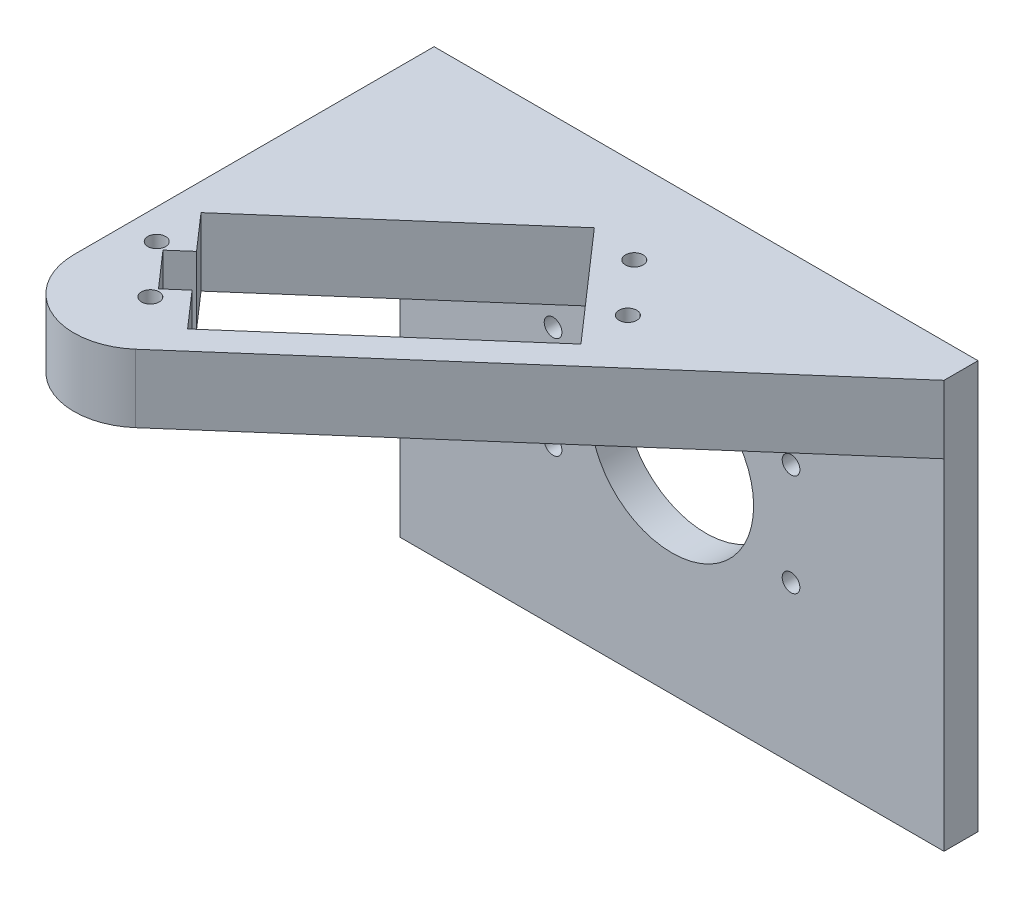
ISO-10303-21;
HEADER;
FILE_DESCRIPTION(('STEP AP214'),'2;1');
FILE_NAME('part.step','',(''),(''),'','','');
FILE_SCHEMA(('AUTOMOTIVE_DESIGN { 1 0 10303 214 1 1 1 1 }'));
ENDSEC;
DATA;
#1=APPLICATION_CONTEXT('core data for automotive mechanical design processes');
#2=APPLICATION_PROTOCOL_DEFINITION('international standard','automotive_design',2000,#1);
#3=PRODUCT_CONTEXT('',#1,'mechanical');
#4=PRODUCT('Part','Part','',(#3));
#5=PRODUCT_RELATED_PRODUCT_CATEGORY('part','',(#4));
#6=PRODUCT_DEFINITION_FORMATION('','',#4);
#7=PRODUCT_DEFINITION_CONTEXT('part definition',#1,'design');
#8=PRODUCT_DEFINITION('design','',#6,#7);
#9=PRODUCT_DEFINITION_SHAPE('','',#8);
#10=(LENGTH_UNIT() NAMED_UNIT(*) SI_UNIT(.MILLI.,.METRE.));
#11=(NAMED_UNIT(*) PLANE_ANGLE_UNIT() SI_UNIT($,.RADIAN.));
#12=(NAMED_UNIT(*) SI_UNIT($,.STERADIAN.) SOLID_ANGLE_UNIT());
#13=UNCERTAINTY_MEASURE_WITH_UNIT(LENGTH_MEASURE(1.E-05),#10,'distance_accuracy_value','');
#14=(GEOMETRIC_REPRESENTATION_CONTEXT(3) GLOBAL_UNCERTAINTY_ASSIGNED_CONTEXT((#13)) GLOBAL_UNIT_ASSIGNED_CONTEXT((#10,
#11,#12)) REPRESENTATION_CONTEXT('',''));
#15=CARTESIAN_POINT('',(0.,0.,0.));
#16=DIRECTION('',(0.,0.,1.));
#17=DIRECTION('',(1.,0.,0.));
#18=AXIS2_PLACEMENT_3D('',#15,#16,#17);
#19=CARTESIAN_POINT('',(0.,0.,0.));
#20=DIRECTION('',(0.,0.,1.));
#21=DIRECTION('',(1.,0.,0.));
#22=AXIS2_PLACEMENT_3D('',#19,#20,#21);
#23=PLANE('',#22);
#24=CARTESIAN_POINT('',(-17.5,8.,0.));
#25=DIRECTION('',(0.,0.,1.));
#26=DIRECTION('',(1.,0.,0.));
#27=AXIS2_PLACEMENT_3D('',#24,#25,#26);
#28=CIRCLE('',#27,1.3);
#29=CARTESIAN_POINT('',(-16.2,8.,0.));
#30=VERTEX_POINT('',#29);
#31=EDGE_CURVE('E658',#30,#30,#28,.T.);
#32=ORIENTED_EDGE('',*,*,#31,.T.);
#33=EDGE_LOOP('',(#32));
#34=FACE_BOUND('',#33,.T.);
#35=CARTESIAN_POINT('',(-17.5,-7.,0.));
#36=DIRECTION('',(0.,0.,1.));
#37=DIRECTION('',(1.,0.,0.));
#38=AXIS2_PLACEMENT_3D('',#35,#36,#37);
#39=CIRCLE('',#38,1.3);
#40=CARTESIAN_POINT('',(-16.2,-7.,0.));
#41=VERTEX_POINT('',#40);
#42=EDGE_CURVE('E664',#41,#41,#39,.T.);
#43=ORIENTED_EDGE('',*,*,#42,.T.);
#44=EDGE_LOOP('',(#43));
#45=FACE_BOUND('',#44,.T.);
#46=CARTESIAN_POINT('',(17.5,8.,0.));
#47=DIRECTION('',(0.,0.,1.));
#48=DIRECTION('',(1.,0.,0.));
#49=AXIS2_PLACEMENT_3D('',#46,#47,#48);
#50=CIRCLE('',#49,1.3);
#51=CARTESIAN_POINT('',(18.8,8.,0.));
#52=VERTEX_POINT('',#51);
#53=EDGE_CURVE('E672',#52,#52,#50,.T.);
#54=ORIENTED_EDGE('',*,*,#53,.T.);
#55=EDGE_LOOP('',(#54));
#56=FACE_BOUND('',#55,.T.);
#57=CARTESIAN_POINT('',(17.5,-7.,0.));
#58=DIRECTION('',(0.,0.,1.));
#59=DIRECTION('',(1.,0.,0.));
#60=AXIS2_PLACEMENT_3D('',#57,#58,#59);
#61=CIRCLE('',#60,1.3);
#62=CARTESIAN_POINT('',(18.8,-7.,0.));
#63=VERTEX_POINT('',#62);
#64=EDGE_CURVE('E289',#63,#63,#61,.T.);
#65=ORIENTED_EDGE('',*,*,#64,.T.);
#66=EDGE_LOOP('',(#65));
#67=FACE_BOUND('',#66,.T.);
#68=DIRECTION('',(1.,0.,0.));
#69=VECTOR('',#68,1.);
#70=CARTESIAN_POINT('',(-40.,-30.,0.));
#71=LINE('',#70,#69);
#72=CARTESIAN_POINT('',(-40.,-30.,0.));
#73=VERTEX_POINT('',#72);
#74=CARTESIAN_POINT('',(40.,-30.,0.));
#75=VERTEX_POINT('',#74);
#76=EDGE_CURVE('E300',#73,#75,#71,.T.);
#77=ORIENTED_EDGE('',*,*,#76,.F.);
#78=DIRECTION('',(0.,-1.,0.));
#79=VECTOR('',#78,1.);
#80=CARTESIAN_POINT('',(-40.,30.,0.));
#81=LINE('',#80,#79);
#82=CARTESIAN_POINT('',(-40.,30.,0.));
#83=VERTEX_POINT('',#82);
#84=EDGE_CURVE('E311',#83,#73,#81,.T.);
#85=ORIENTED_EDGE('',*,*,#84,.F.);
#86=DIRECTION('',(-1.,0.,0.));
#87=VECTOR('',#86,1.);
#88=CARTESIAN_POINT('',(-40.,30.,0.));
#89=LINE('',#88,#87);
#90=CARTESIAN_POINT('',(40.,30.,0.));
#91=VERTEX_POINT('',#90);
#92=EDGE_CURVE('E308',#91,#83,#89,.T.);
#93=ORIENTED_EDGE('',*,*,#92,.F.);
#94=DIRECTION('',(0.,1.,0.));
#95=VECTOR('',#94,1.);
#96=CARTESIAN_POINT('',(40.,30.,0.));
#97=LINE('',#96,#95);
#98=EDGE_CURVE('E296',#75,#91,#97,.T.);
#99=ORIENTED_EDGE('',*,*,#98,.F.);
#100=EDGE_LOOP('',(#77,#85,#93,#99));
#101=FACE_BOUND('',#100,.T.);
#102=CARTESIAN_POINT('',(0.,0.,0.));
#103=DIRECTION('',(0.,0.,-1.));
#104=DIRECTION('',(-1.,0.,0.));
#105=AXIS2_PLACEMENT_3D('',#102,#103,#104);
#106=CIRCLE('',#105,12.);
#107=CARTESIAN_POINT('',(-12.,0.,0.));
#108=VERTEX_POINT('',#107);
#109=EDGE_CURVE('E359',#108,#108,#106,.T.);
#110=ORIENTED_EDGE('',*,*,#109,.F.);
#111=EDGE_LOOP('',(#110));
#112=FACE_BOUND('',#111,.T.);
#113=ADVANCED_FACE('F45',(#34,#45,#56,#67,#101,#112),#23,.F.);
#114=CARTESIAN_POINT('',(40.,30.,5.));
#115=DIRECTION('',(-1.,0.,0.));
#116=DIRECTION('',(0.,-1.,0.));
#117=AXIS2_PLACEMENT_3D('',#114,#115,#116);
#118=PLANE('',#117);
#119=ORIENTED_EDGE('',*,*,#98,.T.);
#120=DIRECTION('',(0.,0.,-1.));
#121=VECTOR('',#120,1.);
#122=CARTESIAN_POINT('',(40.,30.,5.));
#123=LINE('',#122,#121);
#124=CARTESIAN_POINT('',(40.,30.,5.));
#125=VERTEX_POINT('',#124);
#126=EDGE_CURVE('E321',#125,#91,#123,.T.);
#127=ORIENTED_EDGE('',*,*,#126,.F.);
#128=DIRECTION('',(0.,1.,0.));
#129=VECTOR('',#128,1.);
#130=CARTESIAN_POINT('',(40.,20.,5.));
#131=LINE('',#130,#129);
#132=CARTESIAN_POINT('',(40.,20.,5.));
#133=VERTEX_POINT('',#132);
#134=EDGE_CURVE('E281',#133,#125,#131,.T.);
#135=ORIENTED_EDGE('',*,*,#134,.F.);
#136=DIRECTION('',(0.,1.,0.));
#137=VECTOR('',#136,1.);
#138=CARTESIAN_POINT('',(40.,30.,5.));
#139=LINE('',#138,#137);
#140=CARTESIAN_POINT('',(40.,-30.,5.));
#141=VERTEX_POINT('',#140);
#142=EDGE_CURVE('E297',#141,#133,#139,.T.);
#143=ORIENTED_EDGE('',*,*,#142,.F.);
#144=DIRECTION('',(0.,0.,-1.));
#145=VECTOR('',#144,1.);
#146=CARTESIAN_POINT('',(40.,-30.,5.));
#147=LINE('',#146,#145);
#148=EDGE_CURVE('E306',#141,#75,#147,.T.);
#149=ORIENTED_EDGE('',*,*,#148,.T.);
#150=EDGE_LOOP('',(#119,#127,#135,#143,#149));
#151=FACE_BOUND('',#150,.T.);
#152=ADVANCED_FACE('F425',(#151),#118,.F.);
#153=CARTESIAN_POINT('',(-40.,30.,5.));
#154=DIRECTION('',(0.,-1.,0.));
#155=DIRECTION('',(0.,0.,-1.));
#156=AXIS2_PLACEMENT_3D('',#153,#154,#155);
#157=PLANE('',#156);
#158=CARTESIAN_POINT('',(-35.5766756092274,30.,45.2186107395333));
#159=DIRECTION('',(0.,-1.,0.));
#160=DIRECTION('',(0.,0.,-1.));
#161=AXIS2_PLACEMENT_3D('',#158,#159,#160);
#162=CIRCLE('',#161,1.3);
#163=CARTESIAN_POINT('',(-35.5766756092274,30.,43.9186107395333));
#164=VERTEX_POINT('',#163);
#165=EDGE_CURVE('E194',#164,#164,#162,.T.);
#166=ORIENTED_EDGE('',*,*,#165,.T.);
#167=EDGE_LOOP('',(#166));
#168=FACE_BOUND('',#167,.T.);
#169=CARTESIAN_POINT('',(-28.9916295305422,30.,52.744377686602));
#170=DIRECTION('',(0.,-1.,0.));
#171=DIRECTION('',(0.,0.,-1.));
#172=AXIS2_PLACEMENT_3D('',#169,#170,#171);
#173=CIRCLE('',#172,1.3);
#174=CARTESIAN_POINT('',(-28.9916295305422,30.,51.4443776866021));
#175=VERTEX_POINT('',#174);
#176=EDGE_CURVE('E366',#175,#175,#173,.T.);
#177=ORIENTED_EDGE('',*,*,#176,.T.);
#178=EDGE_LOOP('',(#177));
#179=FACE_BOUND('',#178,.T.);
#180=CARTESIAN_POINT('',(8.47163833196618,30.,19.9640183069072));
#181=DIRECTION('',(0.,-1.,0.));
#182=DIRECTION('',(0.,0.,-1.));
#183=AXIS2_PLACEMENT_3D('',#180,#181,#182);
#184=CIRCLE('',#183,1.3);
#185=CARTESIAN_POINT('',(8.47163833196618,30.,18.6640183069072));
#186=VERTEX_POINT('',#185);
#187=EDGE_CURVE('E270',#186,#186,#184,.T.);
#188=ORIENTED_EDGE('',*,*,#187,.T.);
#189=EDGE_LOOP('',(#188));
#190=FACE_BOUND('',#189,.T.);
#191=CARTESIAN_POINT('',(1.886592253281,30.,12.4382513598384));
#192=DIRECTION('',(0.,-1.,0.));
#193=DIRECTION('',(0.,0.,-1.));
#194=AXIS2_PLACEMENT_3D('',#191,#192,#193);
#195=CIRCLE('',#194,1.3);
#196=CARTESIAN_POINT('',(1.886592253281,30.,11.1382513598384));
#197=VERTEX_POINT('',#196);
#198=EDGE_CURVE('E213',#197,#197,#195,.T.);
#199=ORIENTED_EDGE('',*,*,#198,.T.);
#200=EDGE_LOOP('',(#199));
#201=FACE_BOUND('',#200,.T.);
#202=DIRECTION('',(-0.752576694706879,0.,0.658504607868517));
#203=VECTOR('',#202,1.);
#204=CARTESIAN_POINT('',(-31.3904677449204,30.,43.5488311981524));
#205=LINE('',#204,#203);
#206=CARTESIAN_POINT('',(-31.3904677449204,30.,43.5488311981524));
#207=VERTEX_POINT('',#206);
#208=CARTESIAN_POINT('',(-34.0244861763944,30.,45.8535973256922));
#209=VERTEX_POINT('',#208);
#210=EDGE_CURVE('E174',#207,#209,#205,.T.);
#211=ORIENTED_EDGE('',*,*,#210,.F.);
#212=DIRECTION('',(0.658504607868518,0.,0.752576694706878));
#213=VECTOR('',#212,1.);
#214=CARTESIAN_POINT('',(-36.,30.,38.2807943352042));
#215=LINE('',#214,#213);
#216=CARTESIAN_POINT('',(-36.,30.,38.2807943352042));
#217=VERTEX_POINT('',#216);
#218=EDGE_CURVE('E151',#217,#207,#215,.T.);
#219=ORIENTED_EDGE('',*,*,#218,.F.);
#220=DIRECTION('',(-0.752576694706878,0.,0.658504607868518));
#221=VECTOR('',#220,1.);
#222=CARTESIAN_POINT('',(-36.,30.,38.2807943352042));
#223=LINE('',#222,#221);
#224=CARTESIAN_POINT('',(-5.14435551701801,30.,11.282105412595));
#225=VERTEX_POINT('',#224);
#226=EDGE_CURVE('E163',#225,#217,#223,.T.);
#227=ORIENTED_EDGE('',*,*,#226,.F.);
#228=DIRECTION('',(-0.658504607868519,0.,-0.752576694706877));
#229=VECTOR('',#228,1.);
#230=CARTESIAN_POINT('',(-5.14435551701801,30.,11.282105412595));
#231=LINE('',#230,#229);
#232=CARTESIAN_POINT('',(8.68424124822089,30.,27.0862160014394));
#233=VERTEX_POINT('',#232);
#234=EDGE_CURVE('E219',#233,#225,#231,.T.);
#235=ORIENTED_EDGE('',*,*,#234,.F.);
#236=DIRECTION('',(0.752576694706878,0.,-0.658504607868518));
#237=VECTOR('',#236,1.);
#238=CARTESIAN_POINT('',(-22.1714032347611,30.,54.0849049240487));
#239=LINE('',#238,#237);
#240=CARTESIAN_POINT('',(-22.1714032347611,30.,54.0849049240487));
#241=VERTEX_POINT('',#240);
#242=EDGE_CURVE('E225',#241,#233,#239,.T.);
#243=ORIENTED_EDGE('',*,*,#242,.F.);
#244=DIRECTION('',(0.658504607868519,0.,0.752576694706877));
#245=VECTOR('',#244,1.);
#246=CARTESIAN_POINT('',(-26.7809354898407,30.,48.8168680611005));
#247=LINE('',#246,#245);
#248=CARTESIAN_POINT('',(-26.7809354898407,30.,48.8168680611005));
#249=VERTEX_POINT('',#248);
#250=EDGE_CURVE('E228',#249,#241,#247,.T.);
#251=ORIENTED_EDGE('',*,*,#250,.F.);
#252=DIRECTION('',(0.752576694706875,0.,-0.658504607868522));
#253=VECTOR('',#252,1.);
#254=CARTESIAN_POINT('',(-26.7809354898407,30.,48.8168680611005));
#255=LINE('',#254,#253);
#256=CARTESIAN_POINT('',(-29.4149539213148,30.,51.1216341886404));
#257=VERTEX_POINT('',#256);
#258=EDGE_CURVE('E231',#257,#249,#255,.T.);
#259=ORIENTED_EDGE('',*,*,#258,.F.);
#260=DIRECTION('',(0.658504607868517,0.,0.752576694706879));
#261=VECTOR('',#260,1.);
#262=CARTESIAN_POINT('',(-29.4149539213148,30.,51.1216341886404));
#263=LINE('',#262,#261);
#264=EDGE_CURVE('E181',#209,#257,#263,.T.);
#265=ORIENTED_EDGE('',*,*,#264,.F.);
#266=EDGE_LOOP('',(#211,#219,#227,#235,#243,#251,#259,#265));
#267=FACE_BOUND('',#266,.T.);
#268=DIRECTION('',(0.,0.,-1.));
#269=VECTOR('',#268,1.);
#270=CARTESIAN_POINT('',(-40.,30.,5.));
#271=LINE('',#270,#269);
#272=CARTESIAN_POINT('',(-40.,30.,52.9623177340817));
#273=VERTEX_POINT('',#272);
#274=EDGE_CURVE('E318',#273,#83,#271,.T.);
#275=ORIENTED_EDGE('',*,*,#274,.F.);
#276=CARTESIAN_POINT('',(-30.,30.,52.9623177340817));
#277=DIRECTION('',(0.,-1.,0.));
#278=DIRECTION('',(0.,0.,-1.));
#279=AXIS2_PLACEMENT_3D('',#276,#277,#278);
#280=CIRCLE('',#279,10.);
#281=CARTESIAN_POINT('',(-23.4149539213148,30.,60.4880846811505));
#282=VERTEX_POINT('',#281);
#283=EDGE_CURVE('E67',#273,#282,#280,.F.);
#284=ORIENTED_EDGE('',*,*,#283,.T.);
#285=DIRECTION('',(0.752576694706878,0.,-0.658504607868518));
#286=VECTOR('',#285,1.);
#287=CARTESIAN_POINT('',(40.,30.,5.));
#288=LINE('',#287,#286);
#289=EDGE_CURVE('E285',#282,#125,#288,.T.);
#290=ORIENTED_EDGE('',*,*,#289,.T.);
#291=ORIENTED_EDGE('',*,*,#126,.T.);
#292=ORIENTED_EDGE('',*,*,#92,.T.);
#293=EDGE_LOOP('',(#275,#284,#290,#291,#292));
#294=FACE_BOUND('',#293,.T.);
#295=ADVANCED_FACE('F171',(#168,#179,#190,#201,#267,#294),#157,.F.);
#296=CARTESIAN_POINT('',(-40.,30.,5.));
#297=DIRECTION('',(1.,0.,0.));
#298=DIRECTION('',(0.,1.,0.));
#299=AXIS2_PLACEMENT_3D('',#296,#297,#298);
#300=PLANE('',#299);
#301=DIRECTION('',(0.,0.,1.));
#302=VECTOR('',#301,1.);
#303=CARTESIAN_POINT('',(-40.,20.,0.));
#304=LINE('',#303,#302);
#305=CARTESIAN_POINT('',(-40.,20.,5.));
#306=VERTEX_POINT('',#305);
#307=CARTESIAN_POINT('',(-40.,20.,52.9623177340817));
#308=VERTEX_POINT('',#307);
#309=EDGE_CURVE('E282',#306,#308,#304,.T.);
#310=ORIENTED_EDGE('',*,*,#309,.T.);
#311=DIRECTION('',(0.,1.,0.));
#312=VECTOR('',#311,1.);
#313=CARTESIAN_POINT('',(-40.,30.,52.9623177340817));
#314=LINE('',#313,#312);
#315=EDGE_CURVE('E324',#308,#273,#314,.T.);
#316=ORIENTED_EDGE('',*,*,#315,.T.);
#317=ORIENTED_EDGE('',*,*,#274,.T.);
#318=ORIENTED_EDGE('',*,*,#84,.T.);
#319=DIRECTION('',(0.,0.,-1.));
#320=VECTOR('',#319,1.);
#321=CARTESIAN_POINT('',(-40.,-30.,5.));
#322=LINE('',#321,#320);
#323=CARTESIAN_POINT('',(-40.,-30.,5.));
#324=VERTEX_POINT('',#323);
#325=EDGE_CURVE('E316',#324,#73,#322,.T.);
#326=ORIENTED_EDGE('',*,*,#325,.F.);
#327=DIRECTION('',(0.,-1.,0.));
#328=VECTOR('',#327,1.);
#329=CARTESIAN_POINT('',(-40.,30.,5.));
#330=LINE('',#329,#328);
#331=EDGE_CURVE('E299',#306,#324,#330,.T.);
#332=ORIENTED_EDGE('',*,*,#331,.F.);
#333=EDGE_LOOP('',(#310,#316,#317,#318,#326,#332));
#334=FACE_BOUND('',#333,.T.);
#335=ADVANCED_FACE('F330',(#334),#300,.F.);
#336=CARTESIAN_POINT('',(-40.,-30.,5.));
#337=DIRECTION('',(0.,1.,0.));
#338=DIRECTION('',(0.,0.,1.));
#339=AXIS2_PLACEMENT_3D('',#336,#337,#338);
#340=PLANE('',#339);
#341=ORIENTED_EDGE('',*,*,#76,.T.);
#342=ORIENTED_EDGE('',*,*,#148,.F.);
#343=DIRECTION('',(1.,0.,0.));
#344=VECTOR('',#343,1.);
#345=CARTESIAN_POINT('',(-40.,-30.,5.));
#346=LINE('',#345,#344);
#347=EDGE_CURVE('E304',#324,#141,#346,.T.);
#348=ORIENTED_EDGE('',*,*,#347,.F.);
#349=ORIENTED_EDGE('',*,*,#325,.T.);
#350=EDGE_LOOP('',(#341,#342,#348,#349));
#351=FACE_BOUND('',#350,.T.);
#352=ADVANCED_FACE('F345',(#351),#340,.F.);
#353=CARTESIAN_POINT('',(0.,0.,5.));
#354=DIRECTION('',(0.,0.,1.));
#355=DIRECTION('',(1.,0.,0.));
#356=AXIS2_PLACEMENT_3D('',#353,#354,#355);
#357=PLANE('',#356);
#358=CARTESIAN_POINT('',(0.,0.,5.));
#359=DIRECTION('',(0.,0.,1.));
#360=DIRECTION('',(1.,0.,0.));
#361=AXIS2_PLACEMENT_3D('',#358,#359,#360);
#362=CIRCLE('',#361,12.);
#363=CARTESIAN_POINT('',(12.,0.,5.));
#364=VERTEX_POINT('',#363);
#365=EDGE_CURVE('E355',#364,#364,#362,.T.);
#366=ORIENTED_EDGE('',*,*,#365,.F.);
#367=EDGE_LOOP('',(#366));
#368=FACE_BOUND('',#367,.T.);
#369=CARTESIAN_POINT('',(-17.5,8.,5.));
#370=DIRECTION('',(0.,0.,1.));
#371=DIRECTION('',(1.,0.,0.));
#372=AXIS2_PLACEMENT_3D('',#369,#370,#371);
#373=CIRCLE('',#372,1.3);
#374=CARTESIAN_POINT('',(-16.2,8.,5.));
#375=VERTEX_POINT('',#374);
#376=EDGE_CURVE('E168',#375,#375,#373,.T.);
#377=ORIENTED_EDGE('',*,*,#376,.F.);
#378=EDGE_LOOP('',(#377));
#379=FACE_BOUND('',#378,.T.);
#380=CARTESIAN_POINT('',(-17.5,-7.,5.));
#381=DIRECTION('',(0.,0.,1.));
#382=DIRECTION('',(1.,0.,0.));
#383=AXIS2_PLACEMENT_3D('',#380,#381,#382);
#384=CIRCLE('',#383,1.3);
#385=CARTESIAN_POINT('',(-16.2,-7.,5.));
#386=VERTEX_POINT('',#385);
#387=EDGE_CURVE('E662',#386,#386,#384,.T.);
#388=ORIENTED_EDGE('',*,*,#387,.F.);
#389=EDGE_LOOP('',(#388));
#390=FACE_BOUND('',#389,.T.);
#391=CARTESIAN_POINT('',(17.5,8.,5.));
#392=DIRECTION('',(0.,0.,1.));
#393=DIRECTION('',(1.,0.,0.));
#394=AXIS2_PLACEMENT_3D('',#391,#392,#393);
#395=CIRCLE('',#394,1.3);
#396=CARTESIAN_POINT('',(18.8,8.,5.));
#397=VERTEX_POINT('',#396);
#398=EDGE_CURVE('E669',#397,#397,#395,.T.);
#399=ORIENTED_EDGE('',*,*,#398,.F.);
#400=EDGE_LOOP('',(#399));
#401=FACE_BOUND('',#400,.T.);
#402=CARTESIAN_POINT('',(17.5,-7.,5.));
#403=DIRECTION('',(0.,0.,1.));
#404=DIRECTION('',(1.,0.,0.));
#405=AXIS2_PLACEMENT_3D('',#402,#403,#404);
#406=CIRCLE('',#405,1.3);
#407=CARTESIAN_POINT('',(18.8,-7.,5.));
#408=VERTEX_POINT('',#407);
#409=EDGE_CURVE('E675',#408,#408,#406,.T.);
#410=ORIENTED_EDGE('',*,*,#409,.F.);
#411=EDGE_LOOP('',(#410));
#412=FACE_BOUND('',#411,.T.);
#413=DIRECTION('',(1.,0.,0.));
#414=VECTOR('',#413,1.);
#415=CARTESIAN_POINT('',(0.,20.,5.));
#416=LINE('',#415,#414);
#417=EDGE_CURVE('E293',#306,#133,#416,.T.);
#418=ORIENTED_EDGE('',*,*,#417,.F.);
#419=ORIENTED_EDGE('',*,*,#331,.T.);
#420=ORIENTED_EDGE('',*,*,#347,.T.);
#421=ORIENTED_EDGE('',*,*,#142,.T.);
#422=EDGE_LOOP('',(#418,#419,#420,#421));
#423=FACE_BOUND('',#422,.T.);
#424=ADVANCED_FACE('F349',(#368,#379,#390,#401,#412,#423),#357,.T.);
#425=CARTESIAN_POINT('',(40.,20.,5.));
#426=DIRECTION('',(0.658504607868518,0.,0.752576694706878));
#427=DIRECTION('',(0.752576694706878,0.,-0.658504607868518));
#428=AXIS2_PLACEMENT_3D('',#425,#426,#427);
#429=PLANE('',#428);
#430=ORIENTED_EDGE('',*,*,#289,.F.);
#431=DIRECTION('',(0.,1.,0.));
#432=VECTOR('',#431,1.);
#433=CARTESIAN_POINT('',(-23.4149539213148,20.,60.4880846811505));
#434=LINE('',#433,#432);
#435=CARTESIAN_POINT('',(-23.4149539213148,20.,60.4880846811505));
#436=VERTEX_POINT('',#435);
#437=EDGE_CURVE('E53',#282,#436,#434,.F.);
#438=ORIENTED_EDGE('',*,*,#437,.T.);
#439=DIRECTION('',(0.752576694706878,0.,-0.658504607868518));
#440=VECTOR('',#439,1.);
#441=CARTESIAN_POINT('',(40.,20.,5.));
#442=LINE('',#441,#440);
#443=EDGE_CURVE('E279',#436,#133,#442,.T.);
#444=ORIENTED_EDGE('',*,*,#443,.T.);
#445=ORIENTED_EDGE('',*,*,#134,.T.);
#446=EDGE_LOOP('',(#430,#438,#444,#445));
#447=FACE_BOUND('',#446,.T.);
#448=ADVANCED_FACE('F382',(#447),#429,.T.);
#449=CARTESIAN_POINT('',(0.,20.,0.));
#450=DIRECTION('',(0.,-1.,0.));
#451=DIRECTION('',(0.,0.,-1.));
#452=AXIS2_PLACEMENT_3D('',#449,#450,#451);
#453=PLANE('',#452);
#454=CARTESIAN_POINT('',(-35.5766756092274,20.,45.2186107395333));
#455=DIRECTION('',(0.,-1.,0.));
#456=DIRECTION('',(0.,0.,-1.));
#457=AXIS2_PLACEMENT_3D('',#454,#455,#456);
#458=CIRCLE('',#457,1.3);
#459=CARTESIAN_POINT('',(-35.5766756092274,20.,43.9186107395333));
#460=VERTEX_POINT('',#459);
#461=EDGE_CURVE('E201',#460,#460,#458,.T.);
#462=ORIENTED_EDGE('',*,*,#461,.F.);
#463=EDGE_LOOP('',(#462));
#464=FACE_BOUND('',#463,.T.);
#465=CARTESIAN_POINT('',(-28.9916295305422,20.,52.744377686602));
#466=DIRECTION('',(0.,-1.,0.));
#467=DIRECTION('',(0.,0.,-1.));
#468=AXIS2_PLACEMENT_3D('',#465,#466,#467);
#469=CIRCLE('',#468,1.3);
#470=CARTESIAN_POINT('',(-28.9916295305422,20.,51.4443776866021));
#471=VERTEX_POINT('',#470);
#472=EDGE_CURVE('E200',#471,#471,#469,.T.);
#473=ORIENTED_EDGE('',*,*,#472,.F.);
#474=EDGE_LOOP('',(#473));
#475=FACE_BOUND('',#474,.T.);
#476=CARTESIAN_POINT('',(8.47163833196618,20.,19.9640183069072));
#477=DIRECTION('',(0.,-1.,0.));
#478=DIRECTION('',(0.,0.,-1.));
#479=AXIS2_PLACEMENT_3D('',#476,#477,#478);
#480=CIRCLE('',#479,1.3);
#481=CARTESIAN_POINT('',(8.47163833196618,20.,18.6640183069072));
#482=VERTEX_POINT('',#481);
#483=EDGE_CURVE('E275',#482,#482,#480,.T.);
#484=ORIENTED_EDGE('',*,*,#483,.F.);
#485=EDGE_LOOP('',(#484));
#486=FACE_BOUND('',#485,.T.);
#487=CARTESIAN_POINT('',(1.886592253281,20.,12.4382513598384));
#488=DIRECTION('',(0.,-1.,0.));
#489=DIRECTION('',(0.,0.,-1.));
#490=AXIS2_PLACEMENT_3D('',#487,#488,#489);
#491=CIRCLE('',#490,1.3);
#492=CARTESIAN_POINT('',(1.886592253281,20.,11.1382513598384));
#493=VERTEX_POINT('',#492);
#494=EDGE_CURVE('E220',#493,#493,#491,.T.);
#495=ORIENTED_EDGE('',*,*,#494,.F.);
#496=EDGE_LOOP('',(#495));
#497=FACE_BOUND('',#496,.T.);
#498=DIRECTION('',(-0.658504607868518,0.,-0.752576694706878));
#499=VECTOR('',#498,1.);
#500=CARTESIAN_POINT('',(-36.,20.,38.2807943352042));
#501=LINE('',#500,#499);
#502=CARTESIAN_POINT('',(-31.3904677449204,20.,43.5488311981524));
#503=VERTEX_POINT('',#502);
#504=CARTESIAN_POINT('',(-36.,20.,38.2807943352042));
#505=VERTEX_POINT('',#504);
#506=EDGE_CURVE('E154',#503,#505,#501,.T.);
#507=ORIENTED_EDGE('',*,*,#506,.F.);
#508=DIRECTION('',(0.752576694706879,0.,-0.658504607868517));
#509=VECTOR('',#508,1.);
#510=CARTESIAN_POINT('',(-31.3904677449204,20.,43.5488311981524));
#511=LINE('',#510,#509);
#512=CARTESIAN_POINT('',(-34.0244861763944,20.,45.8535973256922));
#513=VERTEX_POINT('',#512);
#514=EDGE_CURVE('E159',#513,#503,#511,.T.);
#515=ORIENTED_EDGE('',*,*,#514,.F.);
#516=DIRECTION('',(-0.658504607868517,0.,-0.752576694706879));
#517=VECTOR('',#516,1.);
#518=CARTESIAN_POINT('',(-29.4149539213148,20.,51.1216341886404));
#519=LINE('',#518,#517);
#520=CARTESIAN_POINT('',(-29.4149539213148,20.,51.1216341886404));
#521=VERTEX_POINT('',#520);
#522=EDGE_CURVE('E404',#521,#513,#519,.T.);
#523=ORIENTED_EDGE('',*,*,#522,.F.);
#524=DIRECTION('',(-0.752576694706875,0.,0.658504607868521));
#525=VECTOR('',#524,1.);
#526=CARTESIAN_POINT('',(-26.7809354898407,20.,48.8168680611005));
#527=LINE('',#526,#525);
#528=CARTESIAN_POINT('',(-26.7809354898407,20.,48.8168680611005));
#529=VERTEX_POINT('',#528);
#530=EDGE_CURVE('E251',#529,#521,#527,.T.);
#531=ORIENTED_EDGE('',*,*,#530,.F.);
#532=DIRECTION('',(-0.658504607868519,0.,-0.752576694706877));
#533=VECTOR('',#532,1.);
#534=CARTESIAN_POINT('',(-26.7809354898407,20.,48.8168680611005));
#535=LINE('',#534,#533);
#536=CARTESIAN_POINT('',(-22.1714032347611,20.,54.0849049240487));
#537=VERTEX_POINT('',#536);
#538=EDGE_CURVE('E401',#537,#529,#535,.T.);
#539=ORIENTED_EDGE('',*,*,#538,.F.);
#540=DIRECTION('',(-0.752576694706878,0.,0.658504607868518));
#541=VECTOR('',#540,1.);
#542=CARTESIAN_POINT('',(-22.1714032347611,20.,54.0849049240487));
#543=LINE('',#542,#541);
#544=CARTESIAN_POINT('',(8.68424124822089,20.,27.0862160014394));
#545=VERTEX_POINT('',#544);
#546=EDGE_CURVE('E396',#545,#537,#543,.T.);
#547=ORIENTED_EDGE('',*,*,#546,.F.);
#548=DIRECTION('',(0.658504607868518,0.,0.752576694706877));
#549=VECTOR('',#548,1.);
#550=CARTESIAN_POINT('',(-5.14435551701801,20.,11.282105412595));
#551=LINE('',#550,#549);
#552=CARTESIAN_POINT('',(-5.14435551701801,20.,11.282105412595));
#553=VERTEX_POINT('',#552);
#554=EDGE_CURVE('E395',#553,#545,#551,.T.);
#555=ORIENTED_EDGE('',*,*,#554,.F.);
#556=DIRECTION('',(0.752576694706878,0.,-0.658504607868518));
#557=VECTOR('',#556,1.);
#558=CARTESIAN_POINT('',(-36.,20.,38.2807943352042));
#559=LINE('',#558,#557);
#560=EDGE_CURVE('E179',#505,#553,#559,.T.);
#561=ORIENTED_EDGE('',*,*,#560,.F.);
#562=EDGE_LOOP('',(#507,#515,#523,#531,#539,#547,#555,#561));
#563=FACE_BOUND('',#562,.T.);
#564=ORIENTED_EDGE('',*,*,#443,.F.);
#565=CARTESIAN_POINT('',(-30.,20.,52.9623177340817));
#566=DIRECTION('',(0.,-1.,0.));
#567=DIRECTION('',(0.,0.,-1.));
#568=AXIS2_PLACEMENT_3D('',#565,#566,#567);
#569=CIRCLE('',#568,10.);
#570=EDGE_CURVE('E12',#436,#308,#569,.T.);
#571=ORIENTED_EDGE('',*,*,#570,.T.);
#572=ORIENTED_EDGE('',*,*,#309,.F.);
#573=ORIENTED_EDGE('',*,*,#417,.T.);
#574=EDGE_LOOP('',(#564,#571,#572,#573));
#575=FACE_BOUND('',#574,.T.);
#576=ADVANCED_FACE('F351',(#464,#475,#486,#497,#563,#575),#453,.T.);
#577=CARTESIAN_POINT('',(17.5,-7.,5.));
#578=DIRECTION('',(0.,0.,1.));
#579=DIRECTION('',(1.,0.,0.));
#580=AXIS2_PLACEMENT_3D('',#577,#578,#579);
#581=CYLINDRICAL_SURFACE('',#580,1.3);
#582=ORIENTED_EDGE('',*,*,#64,.F.);
#583=EDGE_LOOP('',(#582));
#584=FACE_BOUND('',#583,.T.);
#585=ORIENTED_EDGE('',*,*,#409,.T.);
#586=EDGE_LOOP('',(#585));
#587=FACE_BOUND('',#586,.T.);
#588=ADVANCED_FACE('F381',(#584,#587),#581,.F.);
#589=CARTESIAN_POINT('',(17.5,8.,5.));
#590=DIRECTION('',(0.,0.,1.));
#591=DIRECTION('',(1.,0.,0.));
#592=AXIS2_PLACEMENT_3D('',#589,#590,#591);
#593=CYLINDRICAL_SURFACE('',#592,1.3);
#594=ORIENTED_EDGE('',*,*,#53,.F.);
#595=EDGE_LOOP('',(#594));
#596=FACE_BOUND('',#595,.T.);
#597=ORIENTED_EDGE('',*,*,#398,.T.);
#598=EDGE_LOOP('',(#597));
#599=FACE_BOUND('',#598,.T.);
#600=ADVANCED_FACE('F593',(#596,#599),#593,.F.);
#601=CARTESIAN_POINT('',(-17.5,-7.,5.));
#602=DIRECTION('',(0.,0.,1.));
#603=DIRECTION('',(1.,0.,0.));
#604=AXIS2_PLACEMENT_3D('',#601,#602,#603);
#605=CYLINDRICAL_SURFACE('',#604,1.3);
#606=ORIENTED_EDGE('',*,*,#42,.F.);
#607=EDGE_LOOP('',(#606));
#608=FACE_BOUND('',#607,.T.);
#609=ORIENTED_EDGE('',*,*,#387,.T.);
#610=EDGE_LOOP('',(#609));
#611=FACE_BOUND('',#610,.T.);
#612=ADVANCED_FACE('F604',(#608,#611),#605,.F.);
#613=CARTESIAN_POINT('',(-17.5,8.,5.));
#614=DIRECTION('',(0.,0.,1.));
#615=DIRECTION('',(1.,0.,0.));
#616=AXIS2_PLACEMENT_3D('',#613,#614,#615);
#617=CYLINDRICAL_SURFACE('',#616,1.3);
#618=ORIENTED_EDGE('',*,*,#31,.F.);
#619=EDGE_LOOP('',(#618));
#620=FACE_BOUND('',#619,.T.);
#621=ORIENTED_EDGE('',*,*,#376,.T.);
#622=EDGE_LOOP('',(#621));
#623=FACE_BOUND('',#622,.T.);
#624=ADVANCED_FACE('F613',(#620,#623),#617,.F.);
#625=CARTESIAN_POINT('',(-36.,30.001,38.2807943352042));
#626=DIRECTION('',(-0.752576694706878,0.,0.658504607868518));
#627=DIRECTION('',(0.658504607868518,0.,0.752576694706878));
#628=AXIS2_PLACEMENT_3D('',#625,#626,#627);
#629=PLANE('',#628);
#630=ORIENTED_EDGE('',*,*,#218,.T.);
#631=DIRECTION('',(0.,-1.,0.));
#632=VECTOR('',#631,1.);
#633=CARTESIAN_POINT('',(-31.3904677449204,30.001,43.5488311981524));
#634=LINE('',#633,#632);
#635=EDGE_CURVE('E169',#207,#503,#634,.T.);
#636=ORIENTED_EDGE('',*,*,#635,.T.);
#637=ORIENTED_EDGE('',*,*,#506,.T.);
#638=DIRECTION('',(0.,-1.,0.));
#639=VECTOR('',#638,1.);
#640=CARTESIAN_POINT('',(-36.,30.001,38.2807943352042));
#641=LINE('',#640,#639);
#642=EDGE_CURVE('E147',#217,#505,#641,.T.);
#643=ORIENTED_EDGE('',*,*,#642,.F.);
#644=EDGE_LOOP('',(#630,#636,#637,#643));
#645=FACE_BOUND('',#644,.T.);
#646=ADVANCED_FACE('F149',(#645),#629,.F.);
#647=CARTESIAN_POINT('',(-31.3904677449204,30.001,43.5488311981524));
#648=DIRECTION('',(-0.658504607868517,0.,-0.752576694706879));
#649=DIRECTION('',(-0.752576694706879,0.,0.658504607868517));
#650=AXIS2_PLACEMENT_3D('',#647,#648,#649);
#651=PLANE('',#650);
#652=ORIENTED_EDGE('',*,*,#210,.T.);
#653=DIRECTION('',(0.,-1.,0.));
#654=VECTOR('',#653,1.);
#655=CARTESIAN_POINT('',(-34.0244861763944,30.001,45.8535973256922));
#656=LINE('',#655,#654);
#657=EDGE_CURVE('E243',#209,#513,#656,.T.);
#658=ORIENTED_EDGE('',*,*,#657,.T.);
#659=ORIENTED_EDGE('',*,*,#514,.T.);
#660=ORIENTED_EDGE('',*,*,#635,.F.);
#661=EDGE_LOOP('',(#652,#658,#659,#660));
#662=FACE_BOUND('',#661,.T.);
#663=ADVANCED_FACE('F407',(#662),#651,.F.);
#664=CARTESIAN_POINT('',(-29.4149539213148,30.001,51.1216341886404));
#665=DIRECTION('',(-0.752576694706879,0.,0.658504607868517));
#666=DIRECTION('',(0.658504607868517,0.,0.752576694706879));
#667=AXIS2_PLACEMENT_3D('',#664,#665,#666);
#668=PLANE('',#667);
#669=ORIENTED_EDGE('',*,*,#264,.T.);
#670=DIRECTION('',(0.,-1.,0.));
#671=VECTOR('',#670,1.);
#672=CARTESIAN_POINT('',(-29.4149539213148,30.001,51.1216341886404));
#673=LINE('',#672,#671);
#674=EDGE_CURVE('E241',#257,#521,#673,.T.);
#675=ORIENTED_EDGE('',*,*,#674,.T.);
#676=ORIENTED_EDGE('',*,*,#522,.T.);
#677=ORIENTED_EDGE('',*,*,#657,.F.);
#678=EDGE_LOOP('',(#669,#675,#676,#677));
#679=FACE_BOUND('',#678,.T.);
#680=ADVANCED_FACE('F239',(#679),#668,.F.);
#681=CARTESIAN_POINT('',(-26.7809354898407,30.001,48.8168680611005));
#682=DIRECTION('',(0.658504607868521,0.,0.752576694706875));
#683=DIRECTION('',(0.752576694706875,0.,-0.658504607868522));
#684=AXIS2_PLACEMENT_3D('',#681,#682,#683);
#685=PLANE('',#684);
#686=ORIENTED_EDGE('',*,*,#258,.T.);
#687=DIRECTION('',(0.,-1.,0.));
#688=VECTOR('',#687,1.);
#689=CARTESIAN_POINT('',(-26.7809354898407,30.001,48.8168680611005));
#690=LINE('',#689,#688);
#691=EDGE_CURVE('E248',#249,#529,#690,.T.);
#692=ORIENTED_EDGE('',*,*,#691,.T.);
#693=ORIENTED_EDGE('',*,*,#530,.T.);
#694=ORIENTED_EDGE('',*,*,#674,.F.);
#695=EDGE_LOOP('',(#686,#692,#693,#694));
#696=FACE_BOUND('',#695,.T.);
#697=ADVANCED_FACE('F247',(#696),#685,.F.);
#698=CARTESIAN_POINT('',(-26.7809354898407,30.001,48.8168680611005));
#699=DIRECTION('',(-0.752576694706877,0.,0.658504607868519));
#700=DIRECTION('',(0.658504607868519,0.,0.752576694706877));
#701=AXIS2_PLACEMENT_3D('',#698,#699,#700);
#702=PLANE('',#701);
#703=ORIENTED_EDGE('',*,*,#250,.T.);
#704=DIRECTION('',(0.,-1.,0.));
#705=VECTOR('',#704,1.);
#706=CARTESIAN_POINT('',(-22.1714032347611,30.001,54.0849049240487));
#707=LINE('',#706,#705);
#708=EDGE_CURVE('E255',#241,#537,#707,.T.);
#709=ORIENTED_EDGE('',*,*,#708,.T.);
#710=ORIENTED_EDGE('',*,*,#538,.T.);
#711=ORIENTED_EDGE('',*,*,#691,.F.);
#712=EDGE_LOOP('',(#703,#709,#710,#711));
#713=FACE_BOUND('',#712,.T.);
#714=ADVANCED_FACE('F410',(#713),#702,.F.);
#715=CARTESIAN_POINT('',(-22.1714032347611,30.001,54.0849049240487));
#716=DIRECTION('',(0.658504607868518,0.,0.752576694706878));
#717=DIRECTION('',(0.752576694706878,0.,-0.658504607868518));
#718=AXIS2_PLACEMENT_3D('',#715,#716,#717);
#719=PLANE('',#718);
#720=ORIENTED_EDGE('',*,*,#242,.T.);
#721=DIRECTION('',(0.,-1.,0.));
#722=VECTOR('',#721,1.);
#723=CARTESIAN_POINT('',(8.68424124822089,30.001,27.0862160014394));
#724=LINE('',#723,#722);
#725=EDGE_CURVE('E260',#233,#545,#724,.T.);
#726=ORIENTED_EDGE('',*,*,#725,.T.);
#727=ORIENTED_EDGE('',*,*,#546,.T.);
#728=ORIENTED_EDGE('',*,*,#708,.F.);
#729=EDGE_LOOP('',(#720,#726,#727,#728));
#730=FACE_BOUND('',#729,.T.);
#731=ADVANCED_FACE('F412',(#730),#719,.F.);
#732=CARTESIAN_POINT('',(-5.14435551701801,30.001,11.282105412595));
#733=DIRECTION('',(0.752576694706877,0.,-0.658504607868519));
#734=DIRECTION('',(-0.658504607868519,0.,-0.752576694706877));
#735=AXIS2_PLACEMENT_3D('',#732,#733,#734);
#736=PLANE('',#735);
#737=ORIENTED_EDGE('',*,*,#234,.T.);
#738=DIRECTION('',(0.,-1.,0.));
#739=VECTOR('',#738,1.);
#740=CARTESIAN_POINT('',(-5.14435551701801,30.001,11.282105412595));
#741=LINE('',#740,#739);
#742=EDGE_CURVE('E158',#225,#553,#741,.T.);
#743=ORIENTED_EDGE('',*,*,#742,.T.);
#744=ORIENTED_EDGE('',*,*,#554,.T.);
#745=ORIENTED_EDGE('',*,*,#725,.F.);
#746=EDGE_LOOP('',(#737,#743,#744,#745));
#747=FACE_BOUND('',#746,.T.);
#748=ADVANCED_FACE('F414',(#747),#736,.F.);
#749=CARTESIAN_POINT('',(-36.,30.001,38.2807943352042));
#750=DIRECTION('',(-0.658504607868518,0.,-0.752576694706878));
#751=DIRECTION('',(-0.752576694706878,0.,0.658504607868518));
#752=AXIS2_PLACEMENT_3D('',#749,#750,#751);
#753=PLANE('',#752);
#754=ORIENTED_EDGE('',*,*,#226,.T.);
#755=ORIENTED_EDGE('',*,*,#642,.T.);
#756=ORIENTED_EDGE('',*,*,#560,.T.);
#757=ORIENTED_EDGE('',*,*,#742,.F.);
#758=EDGE_LOOP('',(#754,#755,#756,#757));
#759=FACE_BOUND('',#758,.T.);
#760=ADVANCED_FACE('F164',(#759),#753,.F.);
#761=CARTESIAN_POINT('',(1.886592253281,20.,12.4382513598384));
#762=DIRECTION('',(0.,-1.,0.));
#763=DIRECTION('',(0.,0.,-1.));
#764=AXIS2_PLACEMENT_3D('',#761,#762,#763);
#765=CYLINDRICAL_SURFACE('',#764,1.3);
#766=ORIENTED_EDGE('',*,*,#198,.F.);
#767=EDGE_LOOP('',(#766));
#768=FACE_BOUND('',#767,.T.);
#769=ORIENTED_EDGE('',*,*,#494,.T.);
#770=EDGE_LOOP('',(#769));
#771=FACE_BOUND('',#770,.T.);
#772=ADVANCED_FACE('F421',(#768,#771),#765,.F.);
#773=CARTESIAN_POINT('',(8.47163833196618,20.,19.9640183069072));
#774=DIRECTION('',(0.,-1.,0.));
#775=DIRECTION('',(0.,0.,-1.));
#776=AXIS2_PLACEMENT_3D('',#773,#774,#775);
#777=CYLINDRICAL_SURFACE('',#776,1.3);
#778=ORIENTED_EDGE('',*,*,#187,.F.);
#779=EDGE_LOOP('',(#778));
#780=FACE_BOUND('',#779,.T.);
#781=ORIENTED_EDGE('',*,*,#483,.T.);
#782=EDGE_LOOP('',(#781));
#783=FACE_BOUND('',#782,.T.);
#784=ADVANCED_FACE('F453',(#780,#783),#777,.F.);
#785=CARTESIAN_POINT('',(-28.9916295305422,20.,52.744377686602));
#786=DIRECTION('',(0.,-1.,0.));
#787=DIRECTION('',(0.,0.,-1.));
#788=AXIS2_PLACEMENT_3D('',#785,#786,#787);
#789=CYLINDRICAL_SURFACE('',#788,1.3);
#790=ORIENTED_EDGE('',*,*,#176,.F.);
#791=EDGE_LOOP('',(#790));
#792=FACE_BOUND('',#791,.T.);
#793=ORIENTED_EDGE('',*,*,#472,.T.);
#794=EDGE_LOOP('',(#793));
#795=FACE_BOUND('',#794,.T.);
#796=ADVANCED_FACE('F377',(#792,#795),#789,.F.);
#797=CARTESIAN_POINT('',(-35.5766756092274,20.,45.2186107395333));
#798=DIRECTION('',(0.,-1.,0.));
#799=DIRECTION('',(0.,0.,-1.));
#800=AXIS2_PLACEMENT_3D('',#797,#798,#799);
#801=CYLINDRICAL_SURFACE('',#800,1.3);
#802=ORIENTED_EDGE('',*,*,#165,.F.);
#803=EDGE_LOOP('',(#802));
#804=FACE_BOUND('',#803,.T.);
#805=ORIENTED_EDGE('',*,*,#461,.T.);
#806=EDGE_LOOP('',(#805));
#807=FACE_BOUND('',#806,.T.);
#808=ADVANCED_FACE('F506',(#804,#807),#801,.F.);
#809=CARTESIAN_POINT('',(-30.,30.,52.9623177340817));
#810=DIRECTION('',(0.,-1.,0.));
#811=DIRECTION('',(1.,0.,0.));
#812=AXIS2_PLACEMENT_3D('',#809,#810,#811);
#813=CYLINDRICAL_SURFACE('',#812,10.);
#814=ORIENTED_EDGE('',*,*,#570,.F.);
#815=ORIENTED_EDGE('',*,*,#437,.F.);
#816=ORIENTED_EDGE('',*,*,#283,.F.);
#817=ORIENTED_EDGE('',*,*,#315,.F.);
#818=EDGE_LOOP('',(#814,#815,#816,#817));
#819=FACE_BOUND('',#818,.T.);
#820=ADVANCED_FACE('F47',(#819),#813,.T.);
#821=CARTESIAN_POINT('',(0.,0.,0.));
#822=DIRECTION('',(0.,0.,-1.));
#823=DIRECTION('',(-1.,0.,0.));
#824=AXIS2_PLACEMENT_3D('',#821,#822,#823);
#825=CYLINDRICAL_SURFACE('',#824,12.);
#826=ORIENTED_EDGE('',*,*,#109,.T.);
#827=EDGE_LOOP('',(#826));
#828=FACE_BOUND('',#827,.T.);
#829=ORIENTED_EDGE('',*,*,#365,.T.);
#830=EDGE_LOOP('',(#829));
#831=FACE_BOUND('',#830,.T.);
#832=ADVANCED_FACE('F552',(#828,#831),#825,.F.);
#833=CLOSED_SHELL('',(#113,#152,#295,#335,#352,#424,#448,#576,#588,#600,#612,#624,#646,#663,
#680,#697,#714,#731,#748,#760,#772,#784,#796,#808,#820,#832));
#834=MANIFOLD_SOLID_BREP('B2',#833);
#835=ADVANCED_BREP_SHAPE_REPRESENTATION('',(#18,#834),#14);
#836=SHAPE_DEFINITION_REPRESENTATION(#9,#835);
ENDSEC;
END-ISO-10303-21;
